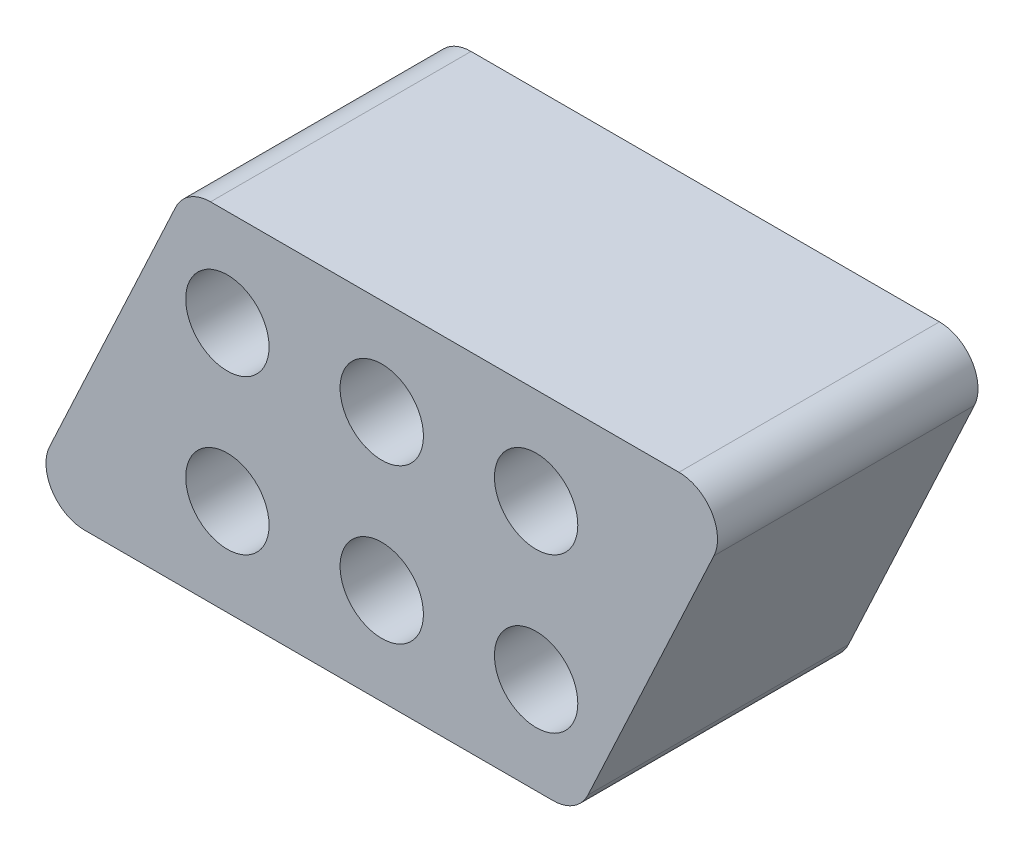
ISO-10303-21;
HEADER;
FILE_DESCRIPTION(('STEP AP214'),'2;1');
FILE_NAME('part.step','',(''),(''),'','','');
FILE_SCHEMA(('AUTOMOTIVE_DESIGN { 1 0 10303 214 1 1 1 1 }'));
ENDSEC;
DATA;
#1=APPLICATION_CONTEXT('core data for automotive mechanical design processes');
#2=APPLICATION_PROTOCOL_DEFINITION('international standard','automotive_design',2000,#1);
#3=PRODUCT_CONTEXT('',#1,'mechanical');
#4=PRODUCT('Part','Part','',(#3));
#5=PRODUCT_RELATED_PRODUCT_CATEGORY('part','',(#4));
#6=PRODUCT_DEFINITION_FORMATION('','',#4);
#7=PRODUCT_DEFINITION_CONTEXT('part definition',#1,'design');
#8=PRODUCT_DEFINITION('design','',#6,#7);
#9=PRODUCT_DEFINITION_SHAPE('','',#8);
#10=(LENGTH_UNIT() NAMED_UNIT(*) SI_UNIT(.MILLI.,.METRE.));
#11=(NAMED_UNIT(*) PLANE_ANGLE_UNIT() SI_UNIT($,.RADIAN.));
#12=(NAMED_UNIT(*) SI_UNIT($,.STERADIAN.) SOLID_ANGLE_UNIT());
#13=UNCERTAINTY_MEASURE_WITH_UNIT(LENGTH_MEASURE(1.E-05),#10,'distance_accuracy_value','');
#14=(GEOMETRIC_REPRESENTATION_CONTEXT(3) GLOBAL_UNCERTAINTY_ASSIGNED_CONTEXT((#13)) GLOBAL_UNIT_ASSIGNED_CONTEXT((#10,
#11,#12)) REPRESENTATION_CONTEXT('',''));
#15=CARTESIAN_POINT('',(0.,0.,0.));
#16=DIRECTION('',(0.,0.,1.));
#17=DIRECTION('',(1.,0.,0.));
#18=AXIS2_PLACEMENT_3D('',#15,#16,#17);
#19=CARTESIAN_POINT('',(-24.4495807611299,-11.1125,21.43125));
#20=DIRECTION('',(0.,0.,-1.));
#21=DIRECTION('',(-1.,0.,0.));
#22=AXIS2_PLACEMENT_3D('',#19,#20,#21);
#23=PLANE('',#22);
#24=CARTESIAN_POINT('',(-24.4495807611299,-11.1125,21.43125));
#25=DIRECTION('',(0.,0.,1.));
#26=DIRECTION('',(-1.,0.,0.));
#27=AXIS2_PLACEMENT_3D('',#24,#25,#26);
#28=CIRCLE('',#27,3.175);
#29=CARTESIAN_POINT('',(-27.3271079849712,-9.77068701897325,21.43125));
#30=VERTEX_POINT('',#29);
#31=CARTESIAN_POINT('',(-24.4495807611298,-14.2875,21.43125));
#32=VERTEX_POINT('',#31);
#33=EDGE_CURVE('E168',#30,#32,#28,.T.);
#34=ORIENTED_EDGE('',*,*,#33,.T.);
#35=DIRECTION('',(1.,0.,0.));
#36=VECTOR('',#35,1.);
#37=CARTESIAN_POINT('',(-24.4495807611298,-14.2875,21.43125));
#38=LINE('',#37,#36);
#39=CARTESIAN_POINT('',(14.0858930586351,-14.2875,21.43125));
#40=VERTEX_POINT('',#39);
#41=EDGE_CURVE('E104',#32,#40,#38,.T.);
#42=ORIENTED_EDGE('',*,*,#41,.T.);
#43=CARTESIAN_POINT('',(14.0858930586351,-11.1125,21.43125));
#44=DIRECTION('',(0.,0.,1.));
#45=DIRECTION('',(1.,0.,0.));
#46=AXIS2_PLACEMENT_3D('',#43,#44,#45);
#47=CIRCLE('',#46,3.175);
#48=CARTESIAN_POINT('',(16.9634202824765,-12.4543129810267,21.43125));
#49=VERTEX_POINT('',#48);
#50=EDGE_CURVE('E189',#40,#49,#47,.T.);
#51=ORIENTED_EDGE('',*,*,#50,.T.);
#52=DIRECTION('',(0.422618261740697,0.906307787036651,0.));
#53=VECTOR('',#52,1.);
#54=CARTESIAN_POINT('',(16.9634202824765,-12.4543129810267,21.43125));
#55=LINE('',#54,#53);
#56=CARTESIAN_POINT('',(27.3271079849712,9.77068701897324,21.43125));
#57=VERTEX_POINT('',#56);
#58=EDGE_CURVE('E203',#49,#57,#55,.T.);
#59=ORIENTED_EDGE('',*,*,#58,.T.);
#60=CARTESIAN_POINT('',(24.4495807611299,11.1125,21.43125));
#61=DIRECTION('',(0.,0.,1.));
#62=DIRECTION('',(1.,0.,0.));
#63=AXIS2_PLACEMENT_3D('',#60,#61,#62);
#64=CIRCLE('',#63,3.175);
#65=CARTESIAN_POINT('',(24.4495807611298,14.2875,21.43125));
#66=VERTEX_POINT('',#65);
#67=EDGE_CURVE('E123',#57,#66,#64,.T.);
#68=ORIENTED_EDGE('',*,*,#67,.T.);
#69=DIRECTION('',(-1.,0.,0.));
#70=VECTOR('',#69,1.);
#71=CARTESIAN_POINT('',(24.4495807611298,14.2875,21.43125));
#72=LINE('',#71,#70);
#73=CARTESIAN_POINT('',(-14.0858930586351,14.2875,21.43125));
#74=VERTEX_POINT('',#73);
#75=EDGE_CURVE('E117',#66,#74,#72,.T.);
#76=ORIENTED_EDGE('',*,*,#75,.T.);
#77=CARTESIAN_POINT('',(-14.0858930586351,11.1125,21.43125));
#78=DIRECTION('',(0.,0.,1.));
#79=DIRECTION('',(1.,0.,0.));
#80=AXIS2_PLACEMENT_3D('',#77,#78,#79);
#81=CIRCLE('',#80,3.175);
#82=CARTESIAN_POINT('',(-16.9634202824765,12.4543129810267,21.43125));
#83=VERTEX_POINT('',#82);
#84=EDGE_CURVE('E121',#74,#83,#81,.T.);
#85=ORIENTED_EDGE('',*,*,#84,.T.);
#86=DIRECTION('',(-0.422618261740697,-0.906307787036651,0.));
#87=VECTOR('',#86,1.);
#88=CARTESIAN_POINT('',(-16.9634202824765,12.4543129810267,21.43125));
#89=LINE('',#88,#87);
#90=EDGE_CURVE('E61',#83,#30,#89,.T.);
#91=ORIENTED_EDGE('',*,*,#90,.T.);
#92=EDGE_LOOP('',(#34,#42,#51,#59,#68,#76,#85,#91));
#93=FACE_BOUND('',#92,.T.);
#94=CARTESIAN_POINT('',(-12.7,-6.35,21.43125));
#95=DIRECTION('',(0.,0.,1.));
#96=DIRECTION('',(1.,0.,0.));
#97=AXIS2_PLACEMENT_3D('',#94,#95,#96);
#98=CIRCLE('',#97,3.429);
#99=CARTESIAN_POINT('',(-9.271,-6.35,21.43125));
#100=VERTEX_POINT('',#99);
#101=EDGE_CURVE('E150',#100,#100,#98,.T.);
#102=ORIENTED_EDGE('',*,*,#101,.F.);
#103=EDGE_LOOP('',(#102));
#104=FACE_BOUND('',#103,.T.);
#105=CARTESIAN_POINT('',(0.,-6.35,21.43125));
#106=DIRECTION('',(0.,0.,1.));
#107=DIRECTION('',(1.,0.,0.));
#108=AXIS2_PLACEMENT_3D('',#105,#106,#107);
#109=CIRCLE('',#108,3.429);
#110=CARTESIAN_POINT('',(3.429,-6.35,21.43125));
#111=VERTEX_POINT('',#110);
#112=EDGE_CURVE('E217',#111,#111,#109,.T.);
#113=ORIENTED_EDGE('',*,*,#112,.F.);
#114=EDGE_LOOP('',(#113));
#115=FACE_BOUND('',#114,.T.);
#116=CARTESIAN_POINT('',(12.7,-6.35,21.43125));
#117=DIRECTION('',(0.,0.,1.));
#118=DIRECTION('',(1.,0.,0.));
#119=AXIS2_PLACEMENT_3D('',#116,#117,#118);
#120=CIRCLE('',#119,3.429);
#121=CARTESIAN_POINT('',(16.129,-6.35,21.43125));
#122=VERTEX_POINT('',#121);
#123=EDGE_CURVE('E225',#122,#122,#120,.T.);
#124=ORIENTED_EDGE('',*,*,#123,.F.);
#125=EDGE_LOOP('',(#124));
#126=FACE_BOUND('',#125,.T.);
#127=CARTESIAN_POINT('',(0.,6.35,21.43125));
#128=DIRECTION('',(0.,0.,1.));
#129=DIRECTION('',(1.,0.,0.));
#130=AXIS2_PLACEMENT_3D('',#127,#128,#129);
#131=CIRCLE('',#130,3.429);
#132=CARTESIAN_POINT('',(3.429,6.35,21.43125));
#133=VERTEX_POINT('',#132);
#134=EDGE_CURVE('E233',#133,#133,#131,.T.);
#135=ORIENTED_EDGE('',*,*,#134,.F.);
#136=EDGE_LOOP('',(#135));
#137=FACE_BOUND('',#136,.T.);
#138=CARTESIAN_POINT('',(12.7,6.35,21.43125));
#139=DIRECTION('',(0.,0.,1.));
#140=DIRECTION('',(1.,0.,0.));
#141=AXIS2_PLACEMENT_3D('',#138,#139,#140);
#142=CIRCLE('',#141,3.429);
#143=CARTESIAN_POINT('',(16.129,6.35,21.43125));
#144=VERTEX_POINT('',#143);
#145=EDGE_CURVE('E241',#144,#144,#142,.T.);
#146=ORIENTED_EDGE('',*,*,#145,.F.);
#147=EDGE_LOOP('',(#146));
#148=FACE_BOUND('',#147,.T.);
#149=CARTESIAN_POINT('',(-12.7,6.35,21.43125));
#150=DIRECTION('',(0.,0.,1.));
#151=DIRECTION('',(1.,0.,0.));
#152=AXIS2_PLACEMENT_3D('',#149,#150,#151);
#153=CIRCLE('',#152,3.429);
#154=CARTESIAN_POINT('',(-9.271,6.35,21.43125));
#155=VERTEX_POINT('',#154);
#156=EDGE_CURVE('E249',#155,#155,#153,.T.);
#157=ORIENTED_EDGE('',*,*,#156,.F.);
#158=EDGE_LOOP('',(#157));
#159=FACE_BOUND('',#158,.T.);
#160=ADVANCED_FACE('F43',(#93,#104,#115,#126,#137,#148,#159),#23,.F.);
#161=CARTESIAN_POINT('',(-24.4495807611299,-11.1125,0.));
#162=DIRECTION('',(0.,0.,-1.));
#163=DIRECTION('',(-1.,0.,0.));
#164=AXIS2_PLACEMENT_3D('',#161,#162,#163);
#165=PLANE('',#164);
#166=CARTESIAN_POINT('',(12.7,6.35,0.));
#167=DIRECTION('',(0.,0.,1.));
#168=DIRECTION('',(1.,0.,0.));
#169=AXIS2_PLACEMENT_3D('',#166,#167,#168);
#170=CIRCLE('',#169,3.429);
#171=CARTESIAN_POINT('',(16.129,6.35,0.));
#172=VERTEX_POINT('',#171);
#173=EDGE_CURVE('E245',#172,#172,#170,.T.);
#174=ORIENTED_EDGE('',*,*,#173,.T.);
#175=EDGE_LOOP('',(#174));
#176=FACE_BOUND('',#175,.T.);
#177=CARTESIAN_POINT('',(12.7,-6.35,0.));
#178=DIRECTION('',(0.,0.,1.));
#179=DIRECTION('',(1.,0.,0.));
#180=AXIS2_PLACEMENT_3D('',#177,#178,#179);
#181=CIRCLE('',#180,3.429);
#182=CARTESIAN_POINT('',(16.129,-6.35,0.));
#183=VERTEX_POINT('',#182);
#184=EDGE_CURVE('E229',#183,#183,#181,.T.);
#185=ORIENTED_EDGE('',*,*,#184,.T.);
#186=EDGE_LOOP('',(#185));
#187=FACE_BOUND('',#186,.T.);
#188=CARTESIAN_POINT('',(-12.7,-6.35,0.));
#189=DIRECTION('',(0.,0.,1.));
#190=DIRECTION('',(1.,0.,0.));
#191=AXIS2_PLACEMENT_3D('',#188,#189,#190);
#192=CIRCLE('',#191,3.429);
#193=CARTESIAN_POINT('',(-9.271,-6.35,0.));
#194=VERTEX_POINT('',#193);
#195=EDGE_CURVE('E213',#194,#194,#192,.T.);
#196=ORIENTED_EDGE('',*,*,#195,.T.);
#197=EDGE_LOOP('',(#196));
#198=FACE_BOUND('',#197,.T.);
#199=CARTESIAN_POINT('',(-24.4495807611299,-11.1125,0.));
#200=DIRECTION('',(0.,0.,1.));
#201=DIRECTION('',(-1.,0.,0.));
#202=AXIS2_PLACEMENT_3D('',#199,#200,#201);
#203=CIRCLE('',#202,3.175);
#204=CARTESIAN_POINT('',(-27.3271079849712,-9.77068701897325,0.));
#205=VERTEX_POINT('',#204);
#206=CARTESIAN_POINT('',(-24.4495807611298,-14.2875,0.));
#207=VERTEX_POINT('',#206);
#208=EDGE_CURVE('E145',#205,#207,#203,.T.);
#209=ORIENTED_EDGE('',*,*,#208,.F.);
#210=DIRECTION('',(-0.422618261740697,-0.906307787036651,0.));
#211=VECTOR('',#210,1.);
#212=CARTESIAN_POINT('',(-16.9634202824765,12.4543129810267,0.));
#213=LINE('',#212,#211);
#214=CARTESIAN_POINT('',(-16.9634202824765,12.4543129810267,0.));
#215=VERTEX_POINT('',#214);
#216=EDGE_CURVE('E96',#215,#205,#213,.T.);
#217=ORIENTED_EDGE('',*,*,#216,.F.);
#218=CARTESIAN_POINT('',(-14.0858930586351,11.1125,0.));
#219=DIRECTION('',(0.,0.,1.));
#220=DIRECTION('',(1.,0.,0.));
#221=AXIS2_PLACEMENT_3D('',#218,#219,#220);
#222=CIRCLE('',#221,3.175);
#223=CARTESIAN_POINT('',(-14.0858930586351,14.2875,0.));
#224=VERTEX_POINT('',#223);
#225=EDGE_CURVE('E90',#224,#215,#222,.T.);
#226=ORIENTED_EDGE('',*,*,#225,.F.);
#227=DIRECTION('',(-1.,0.,0.));
#228=VECTOR('',#227,1.);
#229=CARTESIAN_POINT('',(24.4495807611298,14.2875,0.));
#230=LINE('',#229,#228);
#231=CARTESIAN_POINT('',(24.4495807611298,14.2875,0.));
#232=VERTEX_POINT('',#231);
#233=EDGE_CURVE('E132',#232,#224,#230,.T.);
#234=ORIENTED_EDGE('',*,*,#233,.F.);
#235=CARTESIAN_POINT('',(24.4495807611299,11.1125,0.));
#236=DIRECTION('',(0.,0.,1.));
#237=DIRECTION('',(1.,0.,0.));
#238=AXIS2_PLACEMENT_3D('',#235,#236,#237);
#239=CIRCLE('',#238,3.175);
#240=CARTESIAN_POINT('',(27.3271079849712,9.77068701897324,0.));
#241=VERTEX_POINT('',#240);
#242=EDGE_CURVE('E159',#241,#232,#239,.T.);
#243=ORIENTED_EDGE('',*,*,#242,.F.);
#244=DIRECTION('',(0.422618261740697,0.906307787036651,0.));
#245=VECTOR('',#244,1.);
#246=CARTESIAN_POINT('',(16.9634202824765,-12.4543129810267,0.));
#247=LINE('',#246,#245);
#248=CARTESIAN_POINT('',(16.9634202824765,-12.4543129810267,0.));
#249=VERTEX_POINT('',#248);
#250=EDGE_CURVE('E156',#249,#241,#247,.T.);
#251=ORIENTED_EDGE('',*,*,#250,.F.);
#252=CARTESIAN_POINT('',(14.0858930586351,-11.1125,0.));
#253=DIRECTION('',(0.,0.,1.));
#254=DIRECTION('',(1.,0.,0.));
#255=AXIS2_PLACEMENT_3D('',#252,#253,#254);
#256=CIRCLE('',#255,3.175);
#257=CARTESIAN_POINT('',(14.0858930586351,-14.2875,0.));
#258=VERTEX_POINT('',#257);
#259=EDGE_CURVE('E153',#258,#249,#256,.T.);
#260=ORIENTED_EDGE('',*,*,#259,.F.);
#261=DIRECTION('',(1.,0.,0.));
#262=VECTOR('',#261,1.);
#263=CARTESIAN_POINT('',(-24.4495807611298,-14.2875,0.));
#264=LINE('',#263,#262);
#265=EDGE_CURVE('E149',#207,#258,#264,.T.);
#266=ORIENTED_EDGE('',*,*,#265,.F.);
#267=EDGE_LOOP('',(#209,#217,#226,#234,#243,#251,#260,#266));
#268=FACE_BOUND('',#267,.T.);
#269=CARTESIAN_POINT('',(0.,-6.35,0.));
#270=DIRECTION('',(0.,0.,1.));
#271=DIRECTION('',(1.,0.,0.));
#272=AXIS2_PLACEMENT_3D('',#269,#270,#271);
#273=CIRCLE('',#272,3.429);
#274=CARTESIAN_POINT('',(3.429,-6.35,0.));
#275=VERTEX_POINT('',#274);
#276=EDGE_CURVE('E221',#275,#275,#273,.T.);
#277=ORIENTED_EDGE('',*,*,#276,.T.);
#278=EDGE_LOOP('',(#277));
#279=FACE_BOUND('',#278,.T.);
#280=CARTESIAN_POINT('',(0.,6.35,0.));
#281=DIRECTION('',(0.,0.,1.));
#282=DIRECTION('',(1.,0.,0.));
#283=AXIS2_PLACEMENT_3D('',#280,#281,#282);
#284=CIRCLE('',#283,3.429);
#285=CARTESIAN_POINT('',(3.429,6.35,0.));
#286=VERTEX_POINT('',#285);
#287=EDGE_CURVE('E237',#286,#286,#284,.T.);
#288=ORIENTED_EDGE('',*,*,#287,.T.);
#289=EDGE_LOOP('',(#288));
#290=FACE_BOUND('',#289,.T.);
#291=CARTESIAN_POINT('',(-12.7,6.35,0.));
#292=DIRECTION('',(0.,0.,1.));
#293=DIRECTION('',(1.,0.,0.));
#294=AXIS2_PLACEMENT_3D('',#291,#292,#293);
#295=CIRCLE('',#294,3.429);
#296=CARTESIAN_POINT('',(-9.271,6.35,0.));
#297=VERTEX_POINT('',#296);
#298=EDGE_CURVE('E253',#297,#297,#295,.T.);
#299=ORIENTED_EDGE('',*,*,#298,.T.);
#300=EDGE_LOOP('',(#299));
#301=FACE_BOUND('',#300,.T.);
#302=ADVANCED_FACE('F193',(#176,#187,#198,#268,#279,#290,#301),#165,.T.);
#303=CARTESIAN_POINT('',(-24.4495807611299,-11.1125,21.43125));
#304=DIRECTION('',(0.,0.,-1.));
#305=DIRECTION('',(-1.,0.,0.));
#306=AXIS2_PLACEMENT_3D('',#303,#304,#305);
#307=CYLINDRICAL_SURFACE('',#306,3.175);
#308=ORIENTED_EDGE('',*,*,#208,.T.);
#309=DIRECTION('',(0.,0.,-1.));
#310=VECTOR('',#309,1.);
#311=CARTESIAN_POINT('',(-24.4495807611298,-14.2875,21.43125));
#312=LINE('',#311,#310);
#313=EDGE_CURVE('E11',#32,#207,#312,.T.);
#314=ORIENTED_EDGE('',*,*,#313,.F.);
#315=ORIENTED_EDGE('',*,*,#33,.F.);
#316=DIRECTION('',(0.,0.,-1.));
#317=VECTOR('',#316,1.);
#318=CARTESIAN_POINT('',(-27.3271079849712,-9.77068701897325,21.43125));
#319=LINE('',#318,#317);
#320=EDGE_CURVE('E141',#30,#205,#319,.T.);
#321=ORIENTED_EDGE('',*,*,#320,.T.);
#322=EDGE_LOOP('',(#308,#314,#315,#321));
#323=FACE_BOUND('',#322,.T.);
#324=ADVANCED_FACE('F45',(#323),#307,.T.);
#325=CARTESIAN_POINT('',(-24.4495807611298,-14.2875,21.43125));
#326=DIRECTION('',(0.,1.,0.));
#327=DIRECTION('',(-1.,0.,0.));
#328=AXIS2_PLACEMENT_3D('',#325,#326,#327);
#329=PLANE('',#328);
#330=ORIENTED_EDGE('',*,*,#265,.T.);
#331=DIRECTION('',(0.,0.,-1.));
#332=VECTOR('',#331,1.);
#333=CARTESIAN_POINT('',(14.0858930586351,-14.2875,21.43125));
#334=LINE('',#333,#332);
#335=EDGE_CURVE('E53',#40,#258,#334,.T.);
#336=ORIENTED_EDGE('',*,*,#335,.F.);
#337=ORIENTED_EDGE('',*,*,#41,.F.);
#338=ORIENTED_EDGE('',*,*,#313,.T.);
#339=EDGE_LOOP('',(#330,#336,#337,#338));
#340=FACE_BOUND('',#339,.T.);
#341=ADVANCED_FACE('F287',(#340),#329,.F.);
#342=CARTESIAN_POINT('',(14.0858930586351,-11.1125,21.43125));
#343=DIRECTION('',(0.,0.,-1.));
#344=DIRECTION('',(-1.,0.,0.));
#345=AXIS2_PLACEMENT_3D('',#342,#343,#344);
#346=CYLINDRICAL_SURFACE('',#345,3.175);
#347=ORIENTED_EDGE('',*,*,#259,.T.);
#348=DIRECTION('',(0.,0.,-1.));
#349=VECTOR('',#348,1.);
#350=CARTESIAN_POINT('',(16.9634202824765,-12.4543129810267,21.43125));
#351=LINE('',#350,#349);
#352=EDGE_CURVE('E179',#49,#249,#351,.T.);
#353=ORIENTED_EDGE('',*,*,#352,.F.);
#354=ORIENTED_EDGE('',*,*,#50,.F.);
#355=ORIENTED_EDGE('',*,*,#335,.T.);
#356=EDGE_LOOP('',(#347,#353,#354,#355));
#357=FACE_BOUND('',#356,.T.);
#358=ADVANCED_FACE('F187',(#357),#346,.T.);
#359=CARTESIAN_POINT('',(16.9634202824765,-12.4543129810267,21.43125));
#360=DIRECTION('',(-0.906307787036651,0.422618261740697,0.));
#361=DIRECTION('',(-0.422618261740697,-0.906307787036651,0.));
#362=AXIS2_PLACEMENT_3D('',#359,#360,#361);
#363=PLANE('',#362);
#364=ORIENTED_EDGE('',*,*,#250,.T.);
#365=DIRECTION('',(0.,0.,-1.));
#366=VECTOR('',#365,1.);
#367=CARTESIAN_POINT('',(27.3271079849712,9.77068701897324,21.43125));
#368=LINE('',#367,#366);
#369=EDGE_CURVE('E175',#57,#241,#368,.T.);
#370=ORIENTED_EDGE('',*,*,#369,.F.);
#371=ORIENTED_EDGE('',*,*,#58,.F.);
#372=ORIENTED_EDGE('',*,*,#352,.T.);
#373=EDGE_LOOP('',(#364,#370,#371,#372));
#374=FACE_BOUND('',#373,.T.);
#375=ADVANCED_FACE('F198',(#374),#363,.F.);
#376=CARTESIAN_POINT('',(24.4495807611299,11.1125,21.43125));
#377=DIRECTION('',(0.,0.,-1.));
#378=DIRECTION('',(-1.,0.,0.));
#379=AXIS2_PLACEMENT_3D('',#376,#377,#378);
#380=CYLINDRICAL_SURFACE('',#379,3.175);
#381=ORIENTED_EDGE('',*,*,#242,.T.);
#382=DIRECTION('',(0.,0.,-1.));
#383=VECTOR('',#382,1.);
#384=CARTESIAN_POINT('',(24.4495807611298,14.2875,21.43125));
#385=LINE('',#384,#383);
#386=EDGE_CURVE('E134',#66,#232,#385,.T.);
#387=ORIENTED_EDGE('',*,*,#386,.F.);
#388=ORIENTED_EDGE('',*,*,#67,.F.);
#389=ORIENTED_EDGE('',*,*,#369,.T.);
#390=EDGE_LOOP('',(#381,#387,#388,#389));
#391=FACE_BOUND('',#390,.T.);
#392=ADVANCED_FACE('F201',(#391),#380,.T.);
#393=CARTESIAN_POINT('',(24.4495807611298,14.2875,21.43125));
#394=DIRECTION('',(0.,-1.,0.));
#395=DIRECTION('',(1.,0.,0.));
#396=AXIS2_PLACEMENT_3D('',#393,#394,#395);
#397=PLANE('',#396);
#398=ORIENTED_EDGE('',*,*,#233,.T.);
#399=DIRECTION('',(0.,0.,-1.));
#400=VECTOR('',#399,1.);
#401=CARTESIAN_POINT('',(-14.0858930586351,14.2875,21.43125));
#402=LINE('',#401,#400);
#403=EDGE_CURVE('E129',#74,#224,#402,.T.);
#404=ORIENTED_EDGE('',*,*,#403,.F.);
#405=ORIENTED_EDGE('',*,*,#75,.F.);
#406=ORIENTED_EDGE('',*,*,#386,.T.);
#407=EDGE_LOOP('',(#398,#404,#405,#406));
#408=FACE_BOUND('',#407,.T.);
#409=ADVANCED_FACE('F130',(#408),#397,.F.);
#410=CARTESIAN_POINT('',(-14.0858930586351,11.1125,21.43125));
#411=DIRECTION('',(0.,0.,-1.));
#412=DIRECTION('',(-1.,0.,0.));
#413=AXIS2_PLACEMENT_3D('',#410,#411,#412);
#414=CYLINDRICAL_SURFACE('',#413,3.175);
#415=ORIENTED_EDGE('',*,*,#225,.T.);
#416=DIRECTION('',(0.,0.,-1.));
#417=VECTOR('',#416,1.);
#418=CARTESIAN_POINT('',(-16.9634202824765,12.4543129810267,21.43125));
#419=LINE('',#418,#417);
#420=EDGE_CURVE('E135',#83,#215,#419,.T.);
#421=ORIENTED_EDGE('',*,*,#420,.F.);
#422=ORIENTED_EDGE('',*,*,#84,.F.);
#423=ORIENTED_EDGE('',*,*,#403,.T.);
#424=EDGE_LOOP('',(#415,#421,#422,#423));
#425=FACE_BOUND('',#424,.T.);
#426=ADVANCED_FACE('F137',(#425),#414,.T.);
#427=CARTESIAN_POINT('',(-16.9634202824765,12.4543129810267,21.43125));
#428=DIRECTION('',(0.906307787036651,-0.422618261740697,0.));
#429=DIRECTION('',(0.422618261740697,0.906307787036651,0.));
#430=AXIS2_PLACEMENT_3D('',#427,#428,#429);
#431=PLANE('',#430);
#432=ORIENTED_EDGE('',*,*,#216,.T.);
#433=ORIENTED_EDGE('',*,*,#320,.F.);
#434=ORIENTED_EDGE('',*,*,#90,.F.);
#435=ORIENTED_EDGE('',*,*,#420,.T.);
#436=EDGE_LOOP('',(#432,#433,#434,#435));
#437=FACE_BOUND('',#436,.T.);
#438=ADVANCED_FACE('F275',(#437),#431,.F.);
#439=CARTESIAN_POINT('',(-12.7,-6.35,21.43125));
#440=DIRECTION('',(0.,0.,-1.));
#441=DIRECTION('',(-1.,0.,0.));
#442=AXIS2_PLACEMENT_3D('',#439,#440,#441);
#443=CYLINDRICAL_SURFACE('',#442,3.429);
#444=ORIENTED_EDGE('',*,*,#101,.T.);
#445=EDGE_LOOP('',(#444));
#446=FACE_BOUND('',#445,.T.);
#447=ORIENTED_EDGE('',*,*,#195,.F.);
#448=EDGE_LOOP('',(#447));
#449=FACE_BOUND('',#448,.T.);
#450=ADVANCED_FACE('F272',(#446,#449),#443,.F.);
#451=CARTESIAN_POINT('',(0.,-6.35,21.43125));
#452=DIRECTION('',(0.,0.,-1.));
#453=DIRECTION('',(-1.,0.,0.));
#454=AXIS2_PLACEMENT_3D('',#451,#452,#453);
#455=CYLINDRICAL_SURFACE('',#454,3.429);
#456=ORIENTED_EDGE('',*,*,#112,.T.);
#457=EDGE_LOOP('',(#456));
#458=FACE_BOUND('',#457,.T.);
#459=ORIENTED_EDGE('',*,*,#276,.F.);
#460=EDGE_LOOP('',(#459));
#461=FACE_BOUND('',#460,.T.);
#462=ADVANCED_FACE('F363',(#458,#461),#455,.F.);
#463=CARTESIAN_POINT('',(12.7,-6.35,21.43125));
#464=DIRECTION('',(0.,0.,-1.));
#465=DIRECTION('',(-1.,0.,0.));
#466=AXIS2_PLACEMENT_3D('',#463,#464,#465);
#467=CYLINDRICAL_SURFACE('',#466,3.429);
#468=ORIENTED_EDGE('',*,*,#123,.T.);
#469=EDGE_LOOP('',(#468));
#470=FACE_BOUND('',#469,.T.);
#471=ORIENTED_EDGE('',*,*,#184,.F.);
#472=EDGE_LOOP('',(#471));
#473=FACE_BOUND('',#472,.T.);
#474=ADVANCED_FACE('F372',(#470,#473),#467,.F.);
#475=CARTESIAN_POINT('',(0.,6.35,21.43125));
#476=DIRECTION('',(0.,0.,-1.));
#477=DIRECTION('',(-1.,0.,0.));
#478=AXIS2_PLACEMENT_3D('',#475,#476,#477);
#479=CYLINDRICAL_SURFACE('',#478,3.429);
#480=ORIENTED_EDGE('',*,*,#134,.T.);
#481=EDGE_LOOP('',(#480));
#482=FACE_BOUND('',#481,.T.);
#483=ORIENTED_EDGE('',*,*,#287,.F.);
#484=EDGE_LOOP('',(#483));
#485=FACE_BOUND('',#484,.T.);
#486=ADVANCED_FACE('F381',(#482,#485),#479,.F.);
#487=CARTESIAN_POINT('',(12.7,6.35,21.43125));
#488=DIRECTION('',(0.,0.,-1.));
#489=DIRECTION('',(-1.,0.,0.));
#490=AXIS2_PLACEMENT_3D('',#487,#488,#489);
#491=CYLINDRICAL_SURFACE('',#490,3.429);
#492=ORIENTED_EDGE('',*,*,#145,.T.);
#493=EDGE_LOOP('',(#492));
#494=FACE_BOUND('',#493,.T.);
#495=ORIENTED_EDGE('',*,*,#173,.F.);
#496=EDGE_LOOP('',(#495));
#497=FACE_BOUND('',#496,.T.);
#498=ADVANCED_FACE('F391',(#494,#497),#491,.F.);
#499=CARTESIAN_POINT('',(-12.7,6.35,21.43125));
#500=DIRECTION('',(0.,0.,-1.));
#501=DIRECTION('',(-1.,0.,0.));
#502=AXIS2_PLACEMENT_3D('',#499,#500,#501);
#503=CYLINDRICAL_SURFACE('',#502,3.429);
#504=ORIENTED_EDGE('',*,*,#156,.T.);
#505=EDGE_LOOP('',(#504));
#506=FACE_BOUND('',#505,.T.);
#507=ORIENTED_EDGE('',*,*,#298,.F.);
#508=EDGE_LOOP('',(#507));
#509=FACE_BOUND('',#508,.T.);
#510=ADVANCED_FACE('F261',(#506,#509),#503,.F.);
#511=CLOSED_SHELL('',(#160,#302,#324,#341,#358,#375,#392,#409,#426,#438,#450,#462,#474,#486,
#498,#510));
#512=MANIFOLD_SOLID_BREP('B2',#511);
#513=ADVANCED_BREP_SHAPE_REPRESENTATION('',(#18,#512),#14);
#514=SHAPE_DEFINITION_REPRESENTATION(#9,#513);
ENDSEC;
END-ISO-10303-21;
